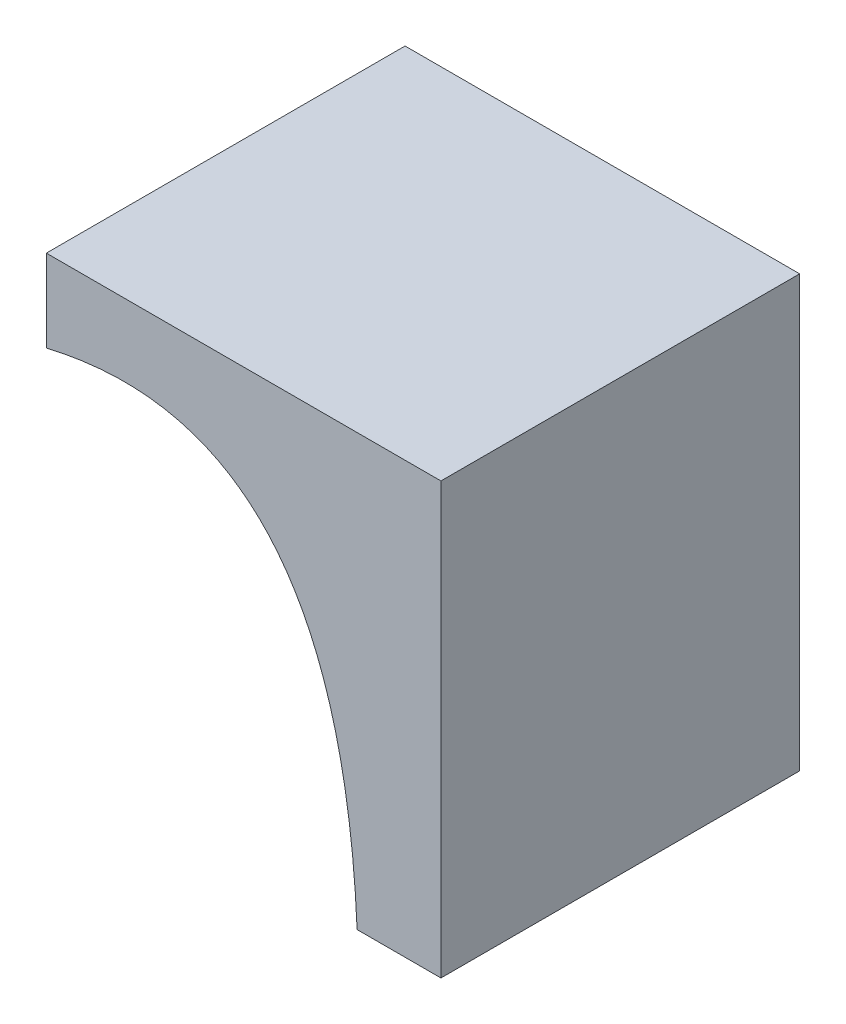
ISO-10303-21;
HEADER;
FILE_DESCRIPTION(('STEP AP214'),'2;1');
FILE_NAME('part.step','',(''),(''),'','','');
FILE_SCHEMA(('AUTOMOTIVE_DESIGN { 1 0 10303 214 1 1 1 1 }'));
ENDSEC;
DATA;
#1=APPLICATION_CONTEXT('core data for automotive mechanical design processes');
#2=APPLICATION_PROTOCOL_DEFINITION('international standard','automotive_design',2000,#1);
#3=PRODUCT_CONTEXT('',#1,'mechanical');
#4=PRODUCT('Part','Part','',(#3));
#5=PRODUCT_RELATED_PRODUCT_CATEGORY('part','',(#4));
#6=PRODUCT_DEFINITION_FORMATION('','',#4);
#7=PRODUCT_DEFINITION_CONTEXT('part definition',#1,'design');
#8=PRODUCT_DEFINITION('design','',#6,#7);
#9=PRODUCT_DEFINITION_SHAPE('','',#8);
#10=(LENGTH_UNIT() NAMED_UNIT(*) SI_UNIT(.MILLI.,.METRE.));
#11=(NAMED_UNIT(*) PLANE_ANGLE_UNIT() SI_UNIT($,.RADIAN.));
#12=(NAMED_UNIT(*) SI_UNIT($,.STERADIAN.) SOLID_ANGLE_UNIT());
#13=UNCERTAINTY_MEASURE_WITH_UNIT(LENGTH_MEASURE(1.E-05),#10,'distance_accuracy_value','');
#14=(GEOMETRIC_REPRESENTATION_CONTEXT(3) GLOBAL_UNCERTAINTY_ASSIGNED_CONTEXT((#13)) GLOBAL_UNIT_ASSIGNED_CONTEXT((#10,
#11,#12)) REPRESENTATION_CONTEXT('',''));
#15=CARTESIAN_POINT('',(0.,0.,0.));
#16=DIRECTION('',(0.,0.,1.));
#17=DIRECTION('',(1.,0.,0.));
#18=AXIS2_PLACEMENT_3D('',#15,#16,#17);
#19=CARTESIAN_POINT('',(69.85,152.4,63.5));
#20=DIRECTION('',(-1.,0.,0.));
#21=DIRECTION('',(0.,0.,1.));
#22=AXIS2_PLACEMENT_3D('',#19,#20,#21);
#23=PLANE('',#22);
#24=DIRECTION('',(0.,0.,-1.));
#25=VECTOR('',#24,1.);
#26=CARTESIAN_POINT('',(69.85,0.,63.5));
#27=LINE('',#26,#25);
#28=CARTESIAN_POINT('',(69.85,0.,63.5));
#29=VERTEX_POINT('',#28);
#30=CARTESIAN_POINT('',(69.85,0.,-63.5));
#31=VERTEX_POINT('',#30);
#32=EDGE_CURVE('E113',#29,#31,#27,.T.);
#33=ORIENTED_EDGE('',*,*,#32,.T.);
#34=DIRECTION('',(0.,-1.,0.));
#35=VECTOR('',#34,1.);
#36=CARTESIAN_POINT('',(69.85,152.4,-63.5));
#37=LINE('',#36,#35);
#38=CARTESIAN_POINT('',(69.85,152.4,-63.5));
#39=VERTEX_POINT('',#38);
#40=EDGE_CURVE('E11',#39,#31,#37,.T.);
#41=ORIENTED_EDGE('',*,*,#40,.F.);
#42=DIRECTION('',(0.,0.,-1.));
#43=VECTOR('',#42,1.);
#44=CARTESIAN_POINT('',(69.85,152.4,63.5));
#45=LINE('',#44,#43);
#46=CARTESIAN_POINT('',(69.85,152.4,63.5));
#47=VERTEX_POINT('',#46);
#48=EDGE_CURVE('E109',#47,#39,#45,.T.);
#49=ORIENTED_EDGE('',*,*,#48,.F.);
#50=DIRECTION('',(0.,-1.,0.));
#51=VECTOR('',#50,1.);
#52=CARTESIAN_POINT('',(69.85,152.4,63.5));
#53=LINE('',#52,#51);
#54=EDGE_CURVE('E104',#47,#29,#53,.T.);
#55=ORIENTED_EDGE('',*,*,#54,.T.);
#56=EDGE_LOOP('',(#33,#41,#49,#55));
#57=FACE_BOUND('',#56,.T.);
#58=ADVANCED_FACE('F37',(#57),#23,.F.);
#59=CARTESIAN_POINT('',(-69.85,152.4,-63.5));
#60=DIRECTION('',(0.,0.,1.));
#61=DIRECTION('',(1.,0.,0.));
#62=AXIS2_PLACEMENT_3D('',#59,#60,#61);
#63=PLANE('',#62);
#64=DIRECTION('',(-1.,0.,0.));
#65=VECTOR('',#64,1.);
#66=CARTESIAN_POINT('',(-69.85,0.,-63.5));
#67=LINE('',#66,#65);
#68=CARTESIAN_POINT('',(40.1787139175548,0.,-63.5));
#69=VERTEX_POINT('',#68);
#70=EDGE_CURVE('E110',#31,#69,#67,.T.);
#71=ORIENTED_EDGE('',*,*,#70,.T.);
#72=CARTESIAN_POINT('',(40.1787139175548,0.,-63.5));
#73=CARTESIAN_POINT('',(33.5901768769769,147.899169191137,-63.5));
#74=CARTESIAN_POINT('',(-69.85,123.28574143106,-63.5));
#75=B_SPLINE_CURVE_WITH_KNOTS('',2,(#72,#73,#74),.UNSPECIFIED.,.F.,.F.,(3,3),(0.,1.),.UNSPECIFIED.);
#76=CARTESIAN_POINT('',(-69.85,123.28574143106,-63.5));
#77=VERTEX_POINT('',#76);
#78=EDGE_CURVE('E51',#77,#69,#75,.F.);
#79=ORIENTED_EDGE('',*,*,#78,.F.);
#80=DIRECTION('',(0.,-1.,0.));
#81=VECTOR('',#80,1.);
#82=CARTESIAN_POINT('',(-69.85,152.4,-63.5));
#83=LINE('',#82,#81);
#84=CARTESIAN_POINT('',(-69.85,152.4,-63.5));
#85=VERTEX_POINT('',#84);
#86=EDGE_CURVE('E44',#85,#77,#83,.T.);
#87=ORIENTED_EDGE('',*,*,#86,.F.);
#88=DIRECTION('',(-1.,0.,0.));
#89=VECTOR('',#88,1.);
#90=CARTESIAN_POINT('',(-69.85,152.4,-63.5));
#91=LINE('',#90,#89);
#92=EDGE_CURVE('E82',#39,#85,#91,.T.);
#93=ORIENTED_EDGE('',*,*,#92,.F.);
#94=ORIENTED_EDGE('',*,*,#40,.T.);
#95=EDGE_LOOP('',(#71,#79,#87,#93,#94));
#96=FACE_BOUND('',#95,.T.);
#97=ADVANCED_FACE('F149',(#96),#63,.F.);
#98=CARTESIAN_POINT('',(-69.85,152.4,63.5));
#99=DIRECTION('',(1.,0.,0.));
#100=DIRECTION('',(0.,0.,-1.));
#101=AXIS2_PLACEMENT_3D('',#98,#99,#100);
#102=PLANE('',#101);
#103=ORIENTED_EDGE('',*,*,#86,.T.);
#104=DIRECTION('',(0.,0.,1.));
#105=VECTOR('',#104,1.);
#106=CARTESIAN_POINT('',(-69.85,123.28574143106,-238.11853230297));
#107=LINE('',#106,#105);
#108=CARTESIAN_POINT('',(-69.85,123.28574143106,63.5));
#109=VERTEX_POINT('',#108);
#110=EDGE_CURVE('E92',#77,#109,#107,.T.);
#111=ORIENTED_EDGE('',*,*,#110,.T.);
#112=DIRECTION('',(0.,-1.,0.));
#113=VECTOR('',#112,1.);
#114=CARTESIAN_POINT('',(-69.85,152.4,63.5));
#115=LINE('',#114,#113);
#116=CARTESIAN_POINT('',(-69.85,152.4,63.5));
#117=VERTEX_POINT('',#116);
#118=EDGE_CURVE('E101',#117,#109,#115,.T.);
#119=ORIENTED_EDGE('',*,*,#118,.F.);
#120=DIRECTION('',(0.,0.,1.));
#121=VECTOR('',#120,1.);
#122=CARTESIAN_POINT('',(-69.85,152.4,63.5));
#123=LINE('',#122,#121);
#124=EDGE_CURVE('E117',#85,#117,#123,.T.);
#125=ORIENTED_EDGE('',*,*,#124,.F.);
#126=EDGE_LOOP('',(#103,#111,#119,#125));
#127=FACE_BOUND('',#126,.T.);
#128=ADVANCED_FACE('F99',(#127),#102,.F.);
#129=CARTESIAN_POINT('',(-69.85,152.4,63.5));
#130=DIRECTION('',(0.,0.,-1.));
#131=DIRECTION('',(-1.,0.,0.));
#132=AXIS2_PLACEMENT_3D('',#129,#130,#131);
#133=PLANE('',#132);
#134=ORIENTED_EDGE('',*,*,#118,.T.);
#135=CARTESIAN_POINT('',(40.1787139175548,0.,63.5));
#136=CARTESIAN_POINT('',(33.5901768769769,147.899169191137,63.5));
#137=CARTESIAN_POINT('',(-69.85,123.28574143106,63.5));
#138=B_SPLINE_CURVE_WITH_KNOTS('',2,(#135,#136,#137),.UNSPECIFIED.,.F.,.F.,(3,3),(0.,1.),.UNSPECIFIED.);
#139=CARTESIAN_POINT('',(40.1787139175548,0.,63.5));
#140=VERTEX_POINT('',#139);
#141=EDGE_CURVE('E89',#140,#109,#138,.T.);
#142=ORIENTED_EDGE('',*,*,#141,.F.);
#143=DIRECTION('',(1.,0.,0.));
#144=VECTOR('',#143,1.);
#145=CARTESIAN_POINT('',(-69.85,0.,63.5));
#146=LINE('',#145,#144);
#147=EDGE_CURVE('E75',#140,#29,#146,.T.);
#148=ORIENTED_EDGE('',*,*,#147,.T.);
#149=ORIENTED_EDGE('',*,*,#54,.F.);
#150=DIRECTION('',(1.,0.,0.));
#151=VECTOR('',#150,1.);
#152=CARTESIAN_POINT('',(-69.85,152.4,63.5));
#153=LINE('',#152,#151);
#154=EDGE_CURVE('E60',#117,#47,#153,.T.);
#155=ORIENTED_EDGE('',*,*,#154,.F.);
#156=EDGE_LOOP('',(#134,#142,#148,#149,#155));
#157=FACE_BOUND('',#156,.T.);
#158=ADVANCED_FACE('F103',(#157),#133,.F.);
#159=CARTESIAN_POINT('',(0.,152.4,0.));
#160=DIRECTION('',(0.,-1.,0.));
#161=DIRECTION('',(0.,0.,-1.));
#162=AXIS2_PLACEMENT_3D('',#159,#160,#161);
#163=PLANE('',#162);
#164=ORIENTED_EDGE('',*,*,#48,.T.);
#165=ORIENTED_EDGE('',*,*,#92,.T.);
#166=ORIENTED_EDGE('',*,*,#124,.T.);
#167=ORIENTED_EDGE('',*,*,#154,.T.);
#168=EDGE_LOOP('',(#164,#165,#166,#167));
#169=FACE_BOUND('',#168,.T.);
#170=ADVANCED_FACE('F140',(#169),#163,.F.);
#171=CARTESIAN_POINT('',(0.,0.,0.));
#172=DIRECTION('',(0.,-1.,0.));
#173=DIRECTION('',(0.,0.,-1.));
#174=AXIS2_PLACEMENT_3D('',#171,#172,#173);
#175=PLANE('',#174);
#176=DIRECTION('',(0.,0.,1.));
#177=VECTOR('',#176,1.);
#178=CARTESIAN_POINT('',(40.1787139175548,0.,-238.11853230297));
#179=LINE('',#178,#177);
#180=EDGE_CURVE('E93',#69,#140,#179,.T.);
#181=ORIENTED_EDGE('',*,*,#180,.F.);
#182=ORIENTED_EDGE('',*,*,#70,.F.);
#183=ORIENTED_EDGE('',*,*,#32,.F.);
#184=ORIENTED_EDGE('',*,*,#147,.F.);
#185=EDGE_LOOP('',(#181,#182,#183,#184));
#186=FACE_BOUND('',#185,.T.);
#187=ADVANCED_FACE('F139',(#186),#175,.T.);
#188=CARTESIAN_POINT('',(40.1787139175548,0.,-238.11853230297));
#189=CARTESIAN_POINT('',(33.5901768769769,147.899169191137,-238.11853230297));
#190=CARTESIAN_POINT('',(-69.85,123.28574143106,-238.11853230297));
#191=B_SPLINE_CURVE_WITH_KNOTS('',2,(#188,#189,#190),.UNSPECIFIED.,.F.,.F.,(3,3),(0.,1.),.UNSPECIFIED.);
#192=DIRECTION('',(0.,0.,1.));
#193=VECTOR('',#192,1.);
#194=SURFACE_OF_LINEAR_EXTRUSION('',#191,#193);
#195=ORIENTED_EDGE('',*,*,#78,.T.);
#196=ORIENTED_EDGE('',*,*,#180,.T.);
#197=ORIENTED_EDGE('',*,*,#141,.T.);
#198=ORIENTED_EDGE('',*,*,#110,.F.);
#199=EDGE_LOOP('',(#195,#196,#197,#198));
#200=FACE_BOUND('',#199,.T.);
#201=ADVANCED_FACE('F91',(#200),#194,.F.);
#202=CLOSED_SHELL('',(#58,#97,#128,#158,#170,#187,#201));
#203=MANIFOLD_SOLID_BREP('B2',#202);
#204=ADVANCED_BREP_SHAPE_REPRESENTATION('',(#18,#203),#14);
#205=SHAPE_DEFINITION_REPRESENTATION(#9,#204);
ENDSEC;
END-ISO-10303-21;
